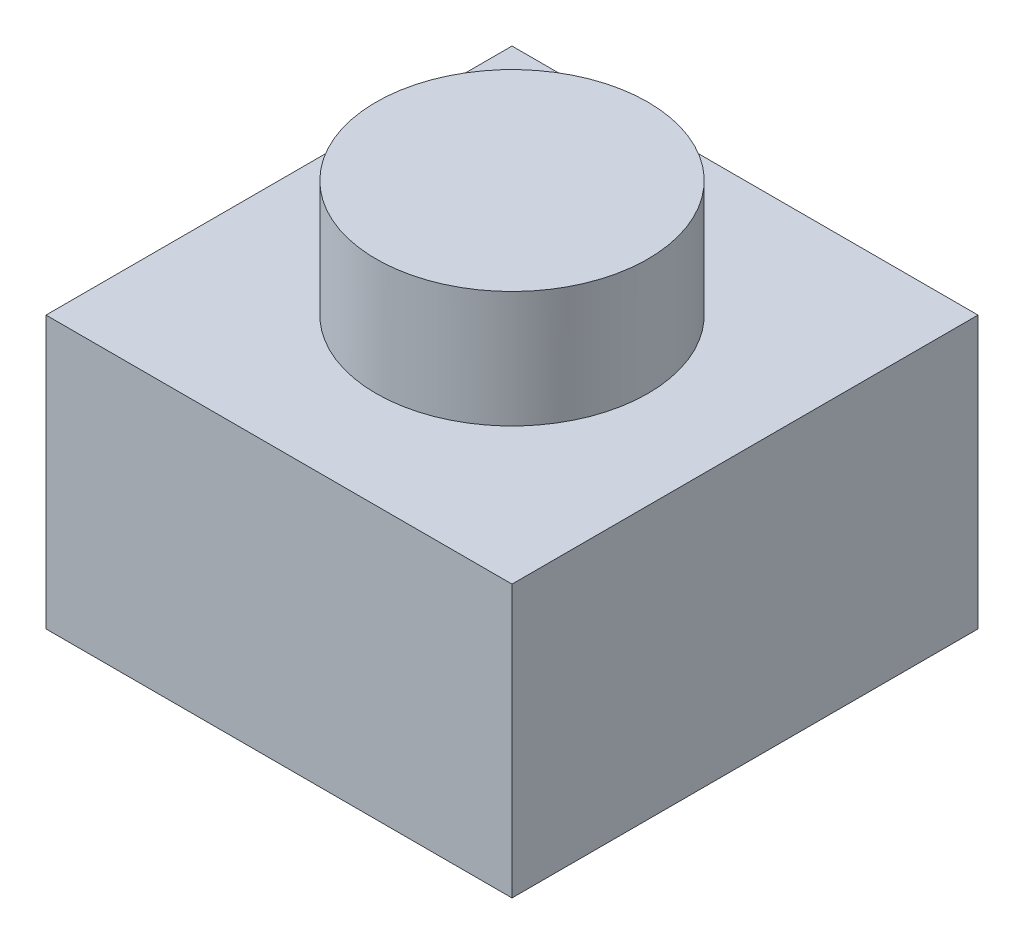
ISO-10303-21;
HEADER;
FILE_DESCRIPTION(('STEP AP214'),'2;1');
FILE_NAME('part.step','',(''),(''),'','','');
FILE_SCHEMA(('AUTOMOTIVE_DESIGN { 1 0 10303 214 1 1 1 1 }'));
ENDSEC;
DATA;
#1=APPLICATION_CONTEXT('core data for automotive mechanical design processes');
#2=APPLICATION_PROTOCOL_DEFINITION('international standard','automotive_design',2000,#1);
#3=PRODUCT_CONTEXT('',#1,'mechanical');
#4=PRODUCT('Part','Part','',(#3));
#5=PRODUCT_RELATED_PRODUCT_CATEGORY('part','',(#4));
#6=PRODUCT_DEFINITION_FORMATION('','',#4);
#7=PRODUCT_DEFINITION_CONTEXT('part definition',#1,'design');
#8=PRODUCT_DEFINITION('design','',#6,#7);
#9=PRODUCT_DEFINITION_SHAPE('','',#8);
#10=(LENGTH_UNIT() NAMED_UNIT(*) SI_UNIT(.MILLI.,.METRE.));
#11=(NAMED_UNIT(*) PLANE_ANGLE_UNIT() SI_UNIT($,.RADIAN.));
#12=(NAMED_UNIT(*) SI_UNIT($,.STERADIAN.) SOLID_ANGLE_UNIT());
#13=UNCERTAINTY_MEASURE_WITH_UNIT(LENGTH_MEASURE(1.E-05),#10,'distance_accuracy_value','');
#14=(GEOMETRIC_REPRESENTATION_CONTEXT(3) GLOBAL_UNCERTAINTY_ASSIGNED_CONTEXT((#13)) GLOBAL_UNIT_ASSIGNED_CONTEXT((#10,
#11,#12)) REPRESENTATION_CONTEXT('',''));
#15=CARTESIAN_POINT('',(0.,0.,0.));
#16=DIRECTION('',(0.,0.,1.));
#17=DIRECTION('',(1.,0.,0.));
#18=AXIS2_PLACEMENT_3D('',#15,#16,#17);
#19=CARTESIAN_POINT('',(3.,3.5,-3.));
#20=DIRECTION('',(-1.,0.,0.));
#21=DIRECTION('',(0.,0.,1.));
#22=AXIS2_PLACEMENT_3D('',#19,#20,#21);
#23=PLANE('',#22);
#24=DIRECTION('',(0.,0.,-1.));
#25=VECTOR('',#24,1.);
#26=CARTESIAN_POINT('',(3.,0.,-3.));
#27=LINE('',#26,#25);
#28=CARTESIAN_POINT('',(3.,0.,3.));
#29=VERTEX_POINT('',#28);
#30=CARTESIAN_POINT('',(3.,0.,-3.));
#31=VERTEX_POINT('',#30);
#32=EDGE_CURVE('E99',#29,#31,#27,.T.);
#33=ORIENTED_EDGE('',*,*,#32,.T.);
#34=DIRECTION('',(0.,-1.,0.));
#35=VECTOR('',#34,1.);
#36=CARTESIAN_POINT('',(3.,3.5,-3.));
#37=LINE('',#36,#35);
#38=CARTESIAN_POINT('',(3.,3.5,-3.));
#39=VERTEX_POINT('',#38);
#40=EDGE_CURVE('E36',#39,#31,#37,.T.);
#41=ORIENTED_EDGE('',*,*,#40,.F.);
#42=DIRECTION('',(0.,0.,-1.));
#43=VECTOR('',#42,1.);
#44=CARTESIAN_POINT('',(3.,3.5,-3.));
#45=LINE('',#44,#43);
#46=CARTESIAN_POINT('',(3.,3.5,3.));
#47=VERTEX_POINT('',#46);
#48=EDGE_CURVE('E86',#47,#39,#45,.T.);
#49=ORIENTED_EDGE('',*,*,#48,.F.);
#50=DIRECTION('',(0.,-1.,0.));
#51=VECTOR('',#50,1.);
#52=CARTESIAN_POINT('',(3.,3.5,3.));
#53=LINE('',#52,#51);
#54=EDGE_CURVE('E95',#47,#29,#53,.T.);
#55=ORIENTED_EDGE('',*,*,#54,.T.);
#56=EDGE_LOOP('',(#33,#41,#49,#55));
#57=FACE_BOUND('',#56,.T.);
#58=ADVANCED_FACE('F33',(#57),#23,.F.);
#59=CARTESIAN_POINT('',(-3.,3.5,-3.));
#60=DIRECTION('',(0.,0.,1.));
#61=DIRECTION('',(1.,0.,0.));
#62=AXIS2_PLACEMENT_3D('',#59,#60,#61);
#63=PLANE('',#62);
#64=DIRECTION('',(-1.,0.,0.));
#65=VECTOR('',#64,1.);
#66=CARTESIAN_POINT('',(-3.,0.,-3.));
#67=LINE('',#66,#65);
#68=CARTESIAN_POINT('',(-3.,0.,-3.));
#69=VERTEX_POINT('',#68);
#70=EDGE_CURVE('E91',#31,#69,#67,.T.);
#71=ORIENTED_EDGE('',*,*,#70,.T.);
#72=DIRECTION('',(0.,-1.,0.));
#73=VECTOR('',#72,1.);
#74=CARTESIAN_POINT('',(-3.,3.5,-3.));
#75=LINE('',#74,#73);
#76=CARTESIAN_POINT('',(-3.,3.5,-3.));
#77=VERTEX_POINT('',#76);
#78=EDGE_CURVE('E89',#77,#69,#75,.T.);
#79=ORIENTED_EDGE('',*,*,#78,.F.);
#80=DIRECTION('',(-1.,0.,0.));
#81=VECTOR('',#80,1.);
#82=CARTESIAN_POINT('',(-3.,3.5,-3.));
#83=LINE('',#82,#81);
#84=EDGE_CURVE('E81',#39,#77,#83,.T.);
#85=ORIENTED_EDGE('',*,*,#84,.F.);
#86=ORIENTED_EDGE('',*,*,#40,.T.);
#87=EDGE_LOOP('',(#71,#79,#85,#86));
#88=FACE_BOUND('',#87,.T.);
#89=ADVANCED_FACE('F90',(#88),#63,.F.);
#90=CARTESIAN_POINT('',(-3.,3.5,-3.));
#91=DIRECTION('',(1.,0.,0.));
#92=DIRECTION('',(0.,0.,-1.));
#93=AXIS2_PLACEMENT_3D('',#90,#91,#92);
#94=PLANE('',#93);
#95=DIRECTION('',(0.,0.,1.));
#96=VECTOR('',#95,1.);
#97=CARTESIAN_POINT('',(-3.,0.,-3.));
#98=LINE('',#97,#96);
#99=CARTESIAN_POINT('',(-3.,0.,3.));
#100=VERTEX_POINT('',#99);
#101=EDGE_CURVE('E67',#69,#100,#98,.T.);
#102=ORIENTED_EDGE('',*,*,#101,.T.);
#103=DIRECTION('',(0.,-1.,0.));
#104=VECTOR('',#103,1.);
#105=CARTESIAN_POINT('',(-3.,3.5,3.));
#106=LINE('',#105,#104);
#107=CARTESIAN_POINT('',(-3.,3.5,3.));
#108=VERTEX_POINT('',#107);
#109=EDGE_CURVE('E92',#108,#100,#106,.T.);
#110=ORIENTED_EDGE('',*,*,#109,.F.);
#111=DIRECTION('',(0.,0.,1.));
#112=VECTOR('',#111,1.);
#113=CARTESIAN_POINT('',(-3.,3.5,-3.));
#114=LINE('',#113,#112);
#115=EDGE_CURVE('E84',#77,#108,#114,.T.);
#116=ORIENTED_EDGE('',*,*,#115,.F.);
#117=ORIENTED_EDGE('',*,*,#78,.T.);
#118=EDGE_LOOP('',(#102,#110,#116,#117));
#119=FACE_BOUND('',#118,.T.);
#120=ADVANCED_FACE('F93',(#119),#94,.F.);
#121=CARTESIAN_POINT('',(-3.,3.5,3.));
#122=DIRECTION('',(0.,0.,-1.));
#123=DIRECTION('',(-1.,0.,0.));
#124=AXIS2_PLACEMENT_3D('',#121,#122,#123);
#125=PLANE('',#124);
#126=DIRECTION('',(1.,0.,0.));
#127=VECTOR('',#126,1.);
#128=CARTESIAN_POINT('',(-3.,0.,3.));
#129=LINE('',#128,#127);
#130=EDGE_CURVE('E73',#100,#29,#129,.T.);
#131=ORIENTED_EDGE('',*,*,#130,.T.);
#132=ORIENTED_EDGE('',*,*,#54,.F.);
#133=DIRECTION('',(1.,0.,0.));
#134=VECTOR('',#133,1.);
#135=CARTESIAN_POINT('',(-3.,3.5,3.));
#136=LINE('',#135,#134);
#137=EDGE_CURVE('E50',#108,#47,#136,.T.);
#138=ORIENTED_EDGE('',*,*,#137,.F.);
#139=ORIENTED_EDGE('',*,*,#109,.T.);
#140=EDGE_LOOP('',(#131,#132,#138,#139));
#141=FACE_BOUND('',#140,.T.);
#142=ADVANCED_FACE('F107',(#141),#125,.F.);
#143=CARTESIAN_POINT('',(0.,3.5,0.));
#144=DIRECTION('',(0.,1.,0.));
#145=DIRECTION('',(0.,0.,1.));
#146=AXIS2_PLACEMENT_3D('',#143,#144,#145);
#147=PLANE('',#146);
#148=CARTESIAN_POINT('',(0.,3.5,0.));
#149=DIRECTION('',(0.,1.,0.));
#150=DIRECTION('',(0.,0.,1.));
#151=AXIS2_PLACEMENT_3D('',#148,#149,#150);
#152=CIRCLE('',#151,1.75);
#153=CARTESIAN_POINT('',(0.,3.5,1.75));
#154=VERTEX_POINT('',#153);
#155=EDGE_CURVE('E11',#154,#154,#152,.T.);
#156=ORIENTED_EDGE('',*,*,#155,.F.);
#157=EDGE_LOOP('',(#156));
#158=FACE_BOUND('',#157,.T.);
#159=ORIENTED_EDGE('',*,*,#48,.T.);
#160=ORIENTED_EDGE('',*,*,#84,.T.);
#161=ORIENTED_EDGE('',*,*,#115,.T.);
#162=ORIENTED_EDGE('',*,*,#137,.T.);
#163=EDGE_LOOP('',(#159,#160,#161,#162));
#164=FACE_BOUND('',#163,.T.);
#165=ADVANCED_FACE('F82',(#158,#164),#147,.T.);
#166=CARTESIAN_POINT('',(0.,0.,0.));
#167=DIRECTION('',(0.,1.,0.));
#168=DIRECTION('',(0.,0.,1.));
#169=AXIS2_PLACEMENT_3D('',#166,#167,#168);
#170=PLANE('',#169);
#171=ORIENTED_EDGE('',*,*,#32,.F.);
#172=ORIENTED_EDGE('',*,*,#130,.F.);
#173=ORIENTED_EDGE('',*,*,#101,.F.);
#174=ORIENTED_EDGE('',*,*,#70,.F.);
#175=EDGE_LOOP('',(#171,#172,#173,#174));
#176=FACE_BOUND('',#175,.T.);
#177=ADVANCED_FACE('F110',(#176),#170,.F.);
#178=CARTESIAN_POINT('',(0.,5.,0.));
#179=DIRECTION('',(0.,-1.,0.));
#180=DIRECTION('',(0.,0.,-1.));
#181=AXIS2_PLACEMENT_3D('',#178,#179,#180);
#182=CYLINDRICAL_SURFACE('',#181,1.75);
#183=ORIENTED_EDGE('',*,*,#155,.T.);
#184=EDGE_LOOP('',(#183));
#185=FACE_BOUND('',#184,.T.);
#186=CARTESIAN_POINT('',(0.,5.,0.));
#187=DIRECTION('',(0.,-1.,0.));
#188=DIRECTION('',(0.,0.,-1.));
#189=AXIS2_PLACEMENT_3D('',#186,#187,#188);
#190=CIRCLE('',#189,1.75);
#191=CARTESIAN_POINT('',(0.,5.,-1.75));
#192=VERTEX_POINT('',#191);
#193=EDGE_CURVE('E102',#192,#192,#190,.T.);
#194=ORIENTED_EDGE('',*,*,#193,.T.);
#195=EDGE_LOOP('',(#194));
#196=FACE_BOUND('',#195,.T.);
#197=ADVANCED_FACE('F116',(#185,#196),#182,.T.);
#198=CARTESIAN_POINT('',(0.,5.,0.));
#199=DIRECTION('',(0.,-1.,0.));
#200=DIRECTION('',(0.,0.,-1.));
#201=AXIS2_PLACEMENT_3D('',#198,#199,#200);
#202=PLANE('',#201);
#203=ORIENTED_EDGE('',*,*,#193,.F.);
#204=EDGE_LOOP('',(#203));
#205=FACE_BOUND('',#204,.T.);
#206=ADVANCED_FACE('F118',(#205),#202,.F.);
#207=CLOSED_SHELL('',(#58,#89,#120,#142,#165,#177,#197,#206));
#208=MANIFOLD_SOLID_BREP('B2',#207);
#209=ADVANCED_BREP_SHAPE_REPRESENTATION('',(#18,#208),#14);
#210=SHAPE_DEFINITION_REPRESENTATION(#9,#209);
ENDSEC;
END-ISO-10303-21;
